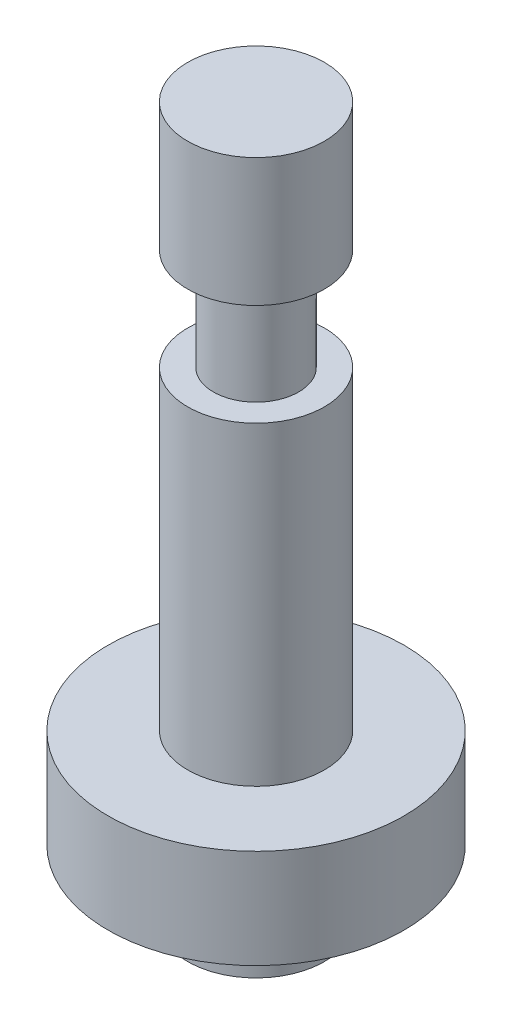
ISO-10303-21;
HEADER;
FILE_DESCRIPTION(('STEP AP214'),'2;1');
FILE_NAME('part.step','',(''),(''),'','','');
FILE_SCHEMA(('AUTOMOTIVE_DESIGN { 1 0 10303 214 1 1 1 1 }'));
ENDSEC;
DATA;
#1=APPLICATION_CONTEXT('core data for automotive mechanical design processes');
#2=APPLICATION_PROTOCOL_DEFINITION('international standard','automotive_design',2000,#1);
#3=PRODUCT_CONTEXT('',#1,'mechanical');
#4=PRODUCT('Part','Part','',(#3));
#5=PRODUCT_RELATED_PRODUCT_CATEGORY('part','',(#4));
#6=PRODUCT_DEFINITION_FORMATION('','',#4);
#7=PRODUCT_DEFINITION_CONTEXT('part definition',#1,'design');
#8=PRODUCT_DEFINITION('design','',#6,#7);
#9=PRODUCT_DEFINITION_SHAPE('','',#8);
#10=(LENGTH_UNIT() NAMED_UNIT(*) SI_UNIT(.MILLI.,.METRE.));
#11=(NAMED_UNIT(*) PLANE_ANGLE_UNIT() SI_UNIT($,.RADIAN.));
#12=(NAMED_UNIT(*) SI_UNIT($,.STERADIAN.) SOLID_ANGLE_UNIT());
#13=UNCERTAINTY_MEASURE_WITH_UNIT(LENGTH_MEASURE(1.E-05),#10,'distance_accuracy_value','');
#14=(GEOMETRIC_REPRESENTATION_CONTEXT(3) GLOBAL_UNCERTAINTY_ASSIGNED_CONTEXT((#13)) GLOBAL_UNIT_ASSIGNED_CONTEXT((#10,
#11,#12)) REPRESENTATION_CONTEXT('',''));
#15=CARTESIAN_POINT('',(0.,0.,0.));
#16=DIRECTION('',(0.,0.,1.));
#17=DIRECTION('',(1.,0.,0.));
#18=AXIS2_PLACEMENT_3D('',#15,#16,#17);
#19=CARTESIAN_POINT('',(0.,65.9721884380712,0.));
#20=DIRECTION('',(0.,1.,0.));
#21=DIRECTION('',(0.,0.,1.));
#22=AXIS2_PLACEMENT_3D('',#19,#20,#21);
#23=PLANE('',#22);
#24=CARTESIAN_POINT('',(0.,65.9721884380712,0.));
#25=DIRECTION('',(0.,-1.,0.));
#26=DIRECTION('',(0.,0.,-1.));
#27=AXIS2_PLACEMENT_3D('',#24,#25,#26);
#28=CIRCLE('',#27,6.34999999999999);
#29=CARTESIAN_POINT('',(0.,65.9721884380712,-6.34999999999999));
#30=VERTEX_POINT('',#29);
#31=EDGE_CURVE('E10',#30,#30,#28,.T.);
#32=ORIENTED_EDGE('',*,*,#31,.F.);
#33=EDGE_LOOP('',(#32));
#34=FACE_BOUND('',#33,.T.);
#35=ADVANCED_FACE('F31',(#34),#23,.T.);
#36=CARTESIAN_POINT('',(0.,0.,0.));
#37=DIRECTION('',(0.,-1.,0.));
#38=DIRECTION('',(0.,0.,-1.));
#39=AXIS2_PLACEMENT_3D('',#36,#37,#38);
#40=CYLINDRICAL_SURFACE('',#39,6.34999999999999);
#41=ORIENTED_EDGE('',*,*,#31,.T.);
#42=EDGE_LOOP('',(#41));
#43=FACE_BOUND('',#42,.T.);
#44=CARTESIAN_POINT('',(0.,54.075564293501,0.));
#45=DIRECTION('',(0.,-1.,0.));
#46=DIRECTION('',(0.,0.,-1.));
#47=AXIS2_PLACEMENT_3D('',#44,#45,#46);
#48=CIRCLE('',#47,6.35);
#49=CARTESIAN_POINT('',(0.,54.075564293501,-6.35));
#50=VERTEX_POINT('',#49);
#51=EDGE_CURVE('E37',#50,#50,#48,.T.);
#52=ORIENTED_EDGE('',*,*,#51,.F.);
#53=EDGE_LOOP('',(#52));
#54=FACE_BOUND('',#53,.T.);
#55=ADVANCED_FACE('F85',(#43,#54),#40,.T.);
#56=CARTESIAN_POINT('',(0.,54.075564293501,-6.35));
#57=DIRECTION('',(0.,-1.,0.));
#58=DIRECTION('',(0.,0.,-1.));
#59=AXIS2_PLACEMENT_3D('',#56,#57,#58);
#60=PLANE('',#59);
#61=ORIENTED_EDGE('',*,*,#51,.T.);
#62=EDGE_LOOP('',(#61));
#63=FACE_BOUND('',#62,.T.);
#64=CARTESIAN_POINT('',(0.,54.075564293501,0.));
#65=DIRECTION('',(0.,-1.,0.));
#66=DIRECTION('',(0.,0.,-1.));
#67=AXIS2_PLACEMENT_3D('',#64,#65,#66);
#68=CIRCLE('',#67,3.95949221563546);
#69=CARTESIAN_POINT('',(0.,54.075564293501,-3.95949221563546));
#70=VERTEX_POINT('',#69);
#71=EDGE_CURVE('E41',#70,#70,#68,.T.);
#72=ORIENTED_EDGE('',*,*,#71,.F.);
#73=EDGE_LOOP('',(#72));
#74=FACE_BOUND('',#73,.T.);
#75=ADVANCED_FACE('F90',(#63,#74),#60,.T.);
#76=CARTESIAN_POINT('',(0.,0.,0.));
#77=DIRECTION('',(0.,-1.,0.));
#78=DIRECTION('',(0.,0.,-1.));
#79=AXIS2_PLACEMENT_3D('',#76,#77,#78);
#80=CYLINDRICAL_SURFACE('',#79,3.95949221563546);
#81=ORIENTED_EDGE('',*,*,#71,.T.);
#82=EDGE_LOOP('',(#81));
#83=FACE_BOUND('',#82,.T.);
#84=CARTESIAN_POINT('',(0.,44.6123405421383,0.));
#85=DIRECTION('',(0.,-1.,0.));
#86=DIRECTION('',(0.,0.,-1.));
#87=AXIS2_PLACEMENT_3D('',#84,#85,#86);
#88=CIRCLE('',#87,3.95949221563546);
#89=CARTESIAN_POINT('',(0.,44.6123405421383,-3.95949221563546));
#90=VERTEX_POINT('',#89);
#91=EDGE_CURVE('E45',#90,#90,#88,.T.);
#92=ORIENTED_EDGE('',*,*,#91,.F.);
#93=EDGE_LOOP('',(#92));
#94=FACE_BOUND('',#93,.T.);
#95=ADVANCED_FACE('F94',(#83,#94),#80,.T.);
#96=CARTESIAN_POINT('',(0.,44.6123405421383,-3.95949221563546));
#97=DIRECTION('',(0.,1.,0.));
#98=DIRECTION('',(0.,0.,1.));
#99=AXIS2_PLACEMENT_3D('',#96,#97,#98);
#100=PLANE('',#99);
#101=ORIENTED_EDGE('',*,*,#91,.T.);
#102=EDGE_LOOP('',(#101));
#103=FACE_BOUND('',#102,.T.);
#104=CARTESIAN_POINT('',(0.,44.6123405421383,0.));
#105=DIRECTION('',(0.,-1.,0.));
#106=DIRECTION('',(0.,0.,-1.));
#107=AXIS2_PLACEMENT_3D('',#104,#105,#106);
#108=CIRCLE('',#107,6.35);
#109=CARTESIAN_POINT('',(0.,44.6123405421383,-6.35));
#110=VERTEX_POINT('',#109);
#111=EDGE_CURVE('E50',#110,#110,#108,.T.);
#112=ORIENTED_EDGE('',*,*,#111,.F.);
#113=EDGE_LOOP('',(#112));
#114=FACE_BOUND('',#113,.T.);
#115=ADVANCED_FACE('F100',(#103,#114),#100,.T.);
#116=CARTESIAN_POINT('',(0.,0.,0.));
#117=DIRECTION('',(0.,-1.,0.));
#118=DIRECTION('',(0.,0.,-1.));
#119=AXIS2_PLACEMENT_3D('',#116,#117,#118);
#120=CYLINDRICAL_SURFACE('',#119,6.35);
#121=ORIENTED_EDGE('',*,*,#111,.T.);
#122=EDGE_LOOP('',(#121));
#123=FACE_BOUND('',#122,.T.);
#124=CARTESIAN_POINT('',(0.,15.4115358236478,0.));
#125=DIRECTION('',(0.,-1.,0.));
#126=DIRECTION('',(0.,0.,-1.));
#127=AXIS2_PLACEMENT_3D('',#124,#125,#126);
#128=CIRCLE('',#127,6.35);
#129=CARTESIAN_POINT('',(0.,15.4115358236478,-6.35));
#130=VERTEX_POINT('',#129);
#131=EDGE_CURVE('E53',#130,#130,#128,.T.);
#132=ORIENTED_EDGE('',*,*,#131,.F.);
#133=EDGE_LOOP('',(#132));
#134=FACE_BOUND('',#133,.T.);
#135=ADVANCED_FACE('F104',(#123,#134),#120,.T.);
#136=CARTESIAN_POINT('',(0.,15.4115358236478,-6.35));
#137=DIRECTION('',(0.,1.,0.));
#138=DIRECTION('',(0.,0.,1.));
#139=AXIS2_PLACEMENT_3D('',#136,#137,#138);
#140=PLANE('',#139);
#141=ORIENTED_EDGE('',*,*,#131,.T.);
#142=EDGE_LOOP('',(#141));
#143=FACE_BOUND('',#142,.T.);
#144=CARTESIAN_POINT('',(0.,15.4115358236478,0.));
#145=DIRECTION('',(0.,-1.,0.));
#146=DIRECTION('',(0.,0.,-1.));
#147=AXIS2_PLACEMENT_3D('',#144,#145,#146);
#148=CIRCLE('',#147,13.738900800291);
#149=CARTESIAN_POINT('',(0.,15.4115358236478,-13.738900800291));
#150=VERTEX_POINT('',#149);
#151=EDGE_CURVE('E56',#150,#150,#148,.T.);
#152=ORIENTED_EDGE('',*,*,#151,.F.);
#153=EDGE_LOOP('',(#152));
#154=FACE_BOUND('',#153,.T.);
#155=ADVANCED_FACE('F108',(#143,#154),#140,.T.);
#156=CARTESIAN_POINT('',(0.,0.,0.));
#157=DIRECTION('',(0.,-1.,0.));
#158=DIRECTION('',(0.,0.,-1.));
#159=AXIS2_PLACEMENT_3D('',#156,#157,#158);
#160=CYLINDRICAL_SURFACE('',#159,13.738900800291);
#161=ORIENTED_EDGE('',*,*,#151,.T.);
#162=EDGE_LOOP('',(#161));
#163=FACE_BOUND('',#162,.T.);
#164=CARTESIAN_POINT('',(0.,6.21868989375261,0.));
#165=DIRECTION('',(0.,-1.,0.));
#166=DIRECTION('',(0.,0.,-1.));
#167=AXIS2_PLACEMENT_3D('',#164,#165,#166);
#168=CIRCLE('',#167,13.738900800291);
#169=CARTESIAN_POINT('',(0.,6.21868989375261,-13.738900800291));
#170=VERTEX_POINT('',#169);
#171=EDGE_CURVE('E59',#170,#170,#168,.T.);
#172=ORIENTED_EDGE('',*,*,#171,.F.);
#173=EDGE_LOOP('',(#172));
#174=FACE_BOUND('',#173,.T.);
#175=ADVANCED_FACE('F81',(#163,#174),#160,.T.);
#176=CARTESIAN_POINT('',(0.,6.21868989375261,-13.738900800291));
#177=DIRECTION('',(0.,-1.,0.));
#178=DIRECTION('',(0.,0.,-1.));
#179=AXIS2_PLACEMENT_3D('',#176,#177,#178);
#180=PLANE('',#179);
#181=ORIENTED_EDGE('',*,*,#171,.T.);
#182=EDGE_LOOP('',(#181));
#183=FACE_BOUND('',#182,.T.);
#184=CARTESIAN_POINT('',(0.,6.21868989375261,0.));
#185=DIRECTION('',(0.,-1.,0.));
#186=DIRECTION('',(0.,0.,-1.));
#187=AXIS2_PLACEMENT_3D('',#184,#185,#186);
#188=CIRCLE('',#187,6.35);
#189=CARTESIAN_POINT('',(0.,6.21868989375261,-6.35));
#190=VERTEX_POINT('',#189);
#191=EDGE_CURVE('E62',#190,#190,#188,.T.);
#192=ORIENTED_EDGE('',*,*,#191,.F.);
#193=EDGE_LOOP('',(#192));
#194=FACE_BOUND('',#193,.T.);
#195=ADVANCED_FACE('F73',(#183,#194),#180,.T.);
#196=CARTESIAN_POINT('',(0.,0.,0.));
#197=DIRECTION('',(0.,-1.,0.));
#198=DIRECTION('',(0.,0.,-1.));
#199=AXIS2_PLACEMENT_3D('',#196,#197,#198);
#200=CYLINDRICAL_SURFACE('',#199,6.35);
#201=ORIENTED_EDGE('',*,*,#191,.T.);
#202=EDGE_LOOP('',(#201));
#203=FACE_BOUND('',#202,.T.);
#204=CARTESIAN_POINT('',(0.,0.,0.));
#205=DIRECTION('',(0.,-1.,0.));
#206=DIRECTION('',(0.,0.,-1.));
#207=AXIS2_PLACEMENT_3D('',#204,#205,#206);
#208=CIRCLE('',#207,6.35);
#209=CARTESIAN_POINT('',(0.,0.,-6.35));
#210=VERTEX_POINT('',#209);
#211=EDGE_CURVE('E65',#210,#210,#208,.T.);
#212=ORIENTED_EDGE('',*,*,#211,.F.);
#213=EDGE_LOOP('',(#212));
#214=FACE_BOUND('',#213,.T.);
#215=ADVANCED_FACE('F71',(#203,#214),#200,.T.);
#216=CARTESIAN_POINT('',(0.,0.,-6.35));
#217=DIRECTION('',(0.,-1.,0.));
#218=DIRECTION('',(0.,0.,-1.));
#219=AXIS2_PLACEMENT_3D('',#216,#217,#218);
#220=PLANE('',#219);
#221=ORIENTED_EDGE('',*,*,#211,.T.);
#222=EDGE_LOOP('',(#221));
#223=FACE_BOUND('',#222,.T.);
#224=ADVANCED_FACE('F69',(#223),#220,.T.);
#225=CLOSED_SHELL('',(#35,#55,#75,#95,#115,#135,#155,#175,#195,#215,#224));
#226=MANIFOLD_SOLID_BREP('B2',#225);
#227=ADVANCED_BREP_SHAPE_REPRESENTATION('',(#18,#226),#14);
#228=SHAPE_DEFINITION_REPRESENTATION(#9,#227);
ENDSEC;
END-ISO-10303-21;
